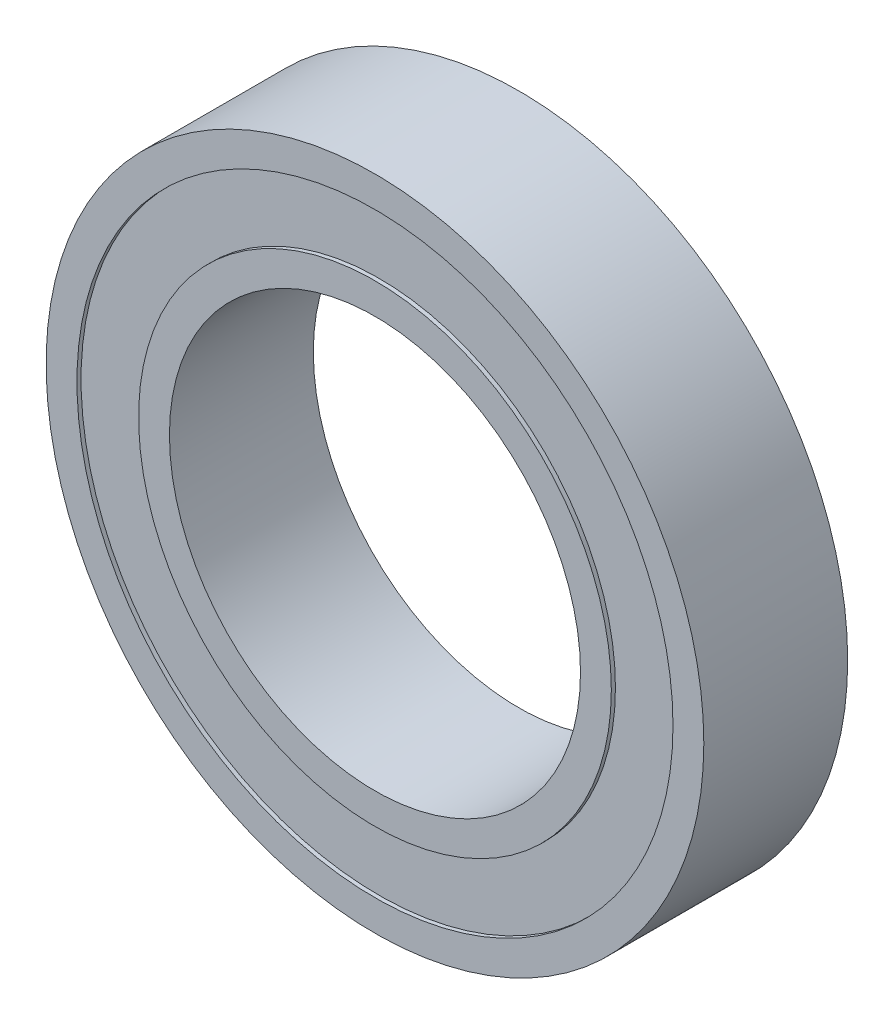
ISO-10303-21;
HEADER;
FILE_DESCRIPTION(('STEP AP214'),'2;1');
FILE_NAME('part.step','',(''),(''),'','','');
FILE_SCHEMA(('AUTOMOTIVE_DESIGN { 1 0 10303 214 1 1 1 1 }'));
ENDSEC;
DATA;
#1=APPLICATION_CONTEXT('core data for automotive mechanical design processes');
#2=APPLICATION_PROTOCOL_DEFINITION('international standard','automotive_design',2000,#1);
#3=PRODUCT_CONTEXT('',#1,'mechanical');
#4=PRODUCT('Part','Part','',(#3));
#5=PRODUCT_RELATED_PRODUCT_CATEGORY('part','',(#4));
#6=PRODUCT_DEFINITION_FORMATION('','',#4);
#7=PRODUCT_DEFINITION_CONTEXT('part definition',#1,'design');
#8=PRODUCT_DEFINITION('design','',#6,#7);
#9=PRODUCT_DEFINITION_SHAPE('','',#8);
#10=(LENGTH_UNIT() NAMED_UNIT(*) SI_UNIT(.MILLI.,.METRE.));
#11=(NAMED_UNIT(*) PLANE_ANGLE_UNIT() SI_UNIT($,.RADIAN.));
#12=(NAMED_UNIT(*) SI_UNIT($,.STERADIAN.) SOLID_ANGLE_UNIT());
#13=UNCERTAINTY_MEASURE_WITH_UNIT(LENGTH_MEASURE(1.E-05),#10,'distance_accuracy_value','');
#14=(GEOMETRIC_REPRESENTATION_CONTEXT(3) GLOBAL_UNCERTAINTY_ASSIGNED_CONTEXT((#13)) GLOBAL_UNIT_ASSIGNED_CONTEXT((#10,
#11,#12)) REPRESENTATION_CONTEXT('',''));
#15=CARTESIAN_POINT('',(0.,0.,0.));
#16=DIRECTION('',(0.,0.,1.));
#17=DIRECTION('',(1.,0.,0.));
#18=AXIS2_PLACEMENT_3D('',#15,#16,#17);
#19=CARTESIAN_POINT('',(0.,0.,0.));
#20=DIRECTION('',(0.,0.,1.));
#21=DIRECTION('',(1.,0.,0.));
#22=AXIS2_PLACEMENT_3D('',#19,#20,#21);
#23=PLANE('',#22);
#24=CARTESIAN_POINT('',(0.,0.,0.));
#25=DIRECTION('',(0.,0.,1.));
#26=DIRECTION('',(1.,0.,0.));
#27=AXIS2_PLACEMENT_3D('',#24,#25,#26);
#28=CIRCLE('',#27,10.);
#29=CARTESIAN_POINT('',(10.,0.,0.));
#30=VERTEX_POINT('',#29);
#31=EDGE_CURVE('E51',#30,#30,#28,.T.);
#32=ORIENTED_EDGE('',*,*,#31,.T.);
#33=EDGE_LOOP('',(#32));
#34=FACE_BOUND('',#33,.T.);
#35=CARTESIAN_POINT('',(0.,0.,0.));
#36=DIRECTION('',(0.,0.,-1.));
#37=DIRECTION('',(-1.,0.,0.));
#38=AXIS2_PLACEMENT_3D('',#35,#36,#37);
#39=CIRCLE('',#38,11.5);
#40=CARTESIAN_POINT('',(-11.5,0.,0.));
#41=VERTEX_POINT('',#40);
#42=EDGE_CURVE('E83',#41,#41,#39,.T.);
#43=ORIENTED_EDGE('',*,*,#42,.T.);
#44=EDGE_LOOP('',(#43));
#45=FACE_BOUND('',#44,.T.);
#46=ADVANCED_FACE('F36',(#34,#45),#23,.F.);
#47=CARTESIAN_POINT('',(0.,0.,7.));
#48=DIRECTION('',(0.,0.,1.));
#49=DIRECTION('',(1.,0.,0.));
#50=AXIS2_PLACEMENT_3D('',#47,#48,#49);
#51=PLANE('',#50);
#52=CARTESIAN_POINT('',(0.,0.,7.));
#53=DIRECTION('',(0.,0.,1.));
#54=DIRECTION('',(1.,0.,0.));
#55=AXIS2_PLACEMENT_3D('',#52,#53,#54);
#56=CIRCLE('',#55,10.);
#57=CARTESIAN_POINT('',(10.,0.,7.));
#58=VERTEX_POINT('',#57);
#59=EDGE_CURVE('E49',#58,#58,#56,.T.);
#60=ORIENTED_EDGE('',*,*,#59,.F.);
#61=EDGE_LOOP('',(#60));
#62=FACE_BOUND('',#61,.T.);
#63=CARTESIAN_POINT('',(0.,0.,7.));
#64=DIRECTION('',(0.,0.,1.));
#65=DIRECTION('',(1.,0.,0.));
#66=AXIS2_PLACEMENT_3D('',#63,#64,#65);
#67=CIRCLE('',#66,11.5);
#68=CARTESIAN_POINT('',(11.5,0.,7.));
#69=VERTEX_POINT('',#68);
#70=EDGE_CURVE('E67',#69,#69,#67,.T.);
#71=ORIENTED_EDGE('',*,*,#70,.T.);
#72=EDGE_LOOP('',(#71));
#73=FACE_BOUND('',#72,.T.);
#74=ADVANCED_FACE('F123',(#62,#73),#51,.T.);
#75=CARTESIAN_POINT('',(0.,0.,7.));
#76=DIRECTION('',(0.,0.,1.));
#77=DIRECTION('',(1.,0.,0.));
#78=AXIS2_PLACEMENT_3D('',#75,#76,#77);
#79=CIRCLE('',#78,14.5);
#80=CARTESIAN_POINT('',(14.5,0.,7.));
#81=VERTEX_POINT('',#80);
#82=EDGE_CURVE('E59',#81,#81,#79,.T.);
#83=ORIENTED_EDGE('',*,*,#82,.F.);
#84=EDGE_LOOP('',(#83));
#85=FACE_BOUND('',#84,.T.);
#86=CARTESIAN_POINT('',(0.,0.,7.));
#87=DIRECTION('',(0.,0.,1.));
#88=DIRECTION('',(1.,0.,0.));
#89=AXIS2_PLACEMENT_3D('',#86,#87,#88);
#90=CIRCLE('',#89,16.);
#91=CARTESIAN_POINT('',(16.,0.,7.));
#92=VERTEX_POINT('',#91);
#93=EDGE_CURVE('E10',#92,#92,#90,.T.);
#94=ORIENTED_EDGE('',*,*,#93,.T.);
#95=EDGE_LOOP('',(#94));
#96=FACE_BOUND('',#95,.T.);
#97=ADVANCED_FACE('F110',(#85,#96),#51,.T.);
#98=CARTESIAN_POINT('',(0.,0.,0.));
#99=DIRECTION('',(0.,0.,-1.));
#100=DIRECTION('',(-1.,0.,0.));
#101=AXIS2_PLACEMENT_3D('',#98,#99,#100);
#102=CIRCLE('',#101,14.5);
#103=CARTESIAN_POINT('',(-14.5,0.,0.));
#104=VERTEX_POINT('',#103);
#105=EDGE_CURVE('E75',#104,#104,#102,.T.);
#106=ORIENTED_EDGE('',*,*,#105,.F.);
#107=EDGE_LOOP('',(#106));
#108=FACE_BOUND('',#107,.T.);
#109=CARTESIAN_POINT('',(0.,0.,0.));
#110=DIRECTION('',(0.,0.,1.));
#111=DIRECTION('',(1.,0.,0.));
#112=AXIS2_PLACEMENT_3D('',#109,#110,#111);
#113=CIRCLE('',#112,16.);
#114=CARTESIAN_POINT('',(16.,0.,0.));
#115=VERTEX_POINT('',#114);
#116=EDGE_CURVE('E40',#115,#115,#113,.T.);
#117=ORIENTED_EDGE('',*,*,#116,.F.);
#118=EDGE_LOOP('',(#117));
#119=FACE_BOUND('',#118,.T.);
#120=ADVANCED_FACE('F107',(#108,#119),#23,.F.);
#121=CARTESIAN_POINT('',(0.,0.,7.));
#122=DIRECTION('',(0.,0.,-1.));
#123=DIRECTION('',(-1.,0.,0.));
#124=AXIS2_PLACEMENT_3D('',#121,#122,#123);
#125=CYLINDRICAL_SURFACE('',#124,16.);
#126=ORIENTED_EDGE('',*,*,#93,.F.);
#127=EDGE_LOOP('',(#126));
#128=FACE_BOUND('',#127,.T.);
#129=ORIENTED_EDGE('',*,*,#116,.T.);
#130=EDGE_LOOP('',(#129));
#131=FACE_BOUND('',#130,.T.);
#132=ADVANCED_FACE('F38',(#128,#131),#125,.T.);
#133=CARTESIAN_POINT('',(0.,0.,7.));
#134=DIRECTION('',(0.,0.,-1.));
#135=DIRECTION('',(-1.,0.,0.));
#136=AXIS2_PLACEMENT_3D('',#133,#134,#135);
#137=CYLINDRICAL_SURFACE('',#136,10.);
#138=ORIENTED_EDGE('',*,*,#59,.T.);
#139=EDGE_LOOP('',(#138));
#140=FACE_BOUND('',#139,.T.);
#141=ORIENTED_EDGE('',*,*,#31,.F.);
#142=EDGE_LOOP('',(#141));
#143=FACE_BOUND('',#142,.T.);
#144=ADVANCED_FACE('F114',(#140,#143),#137,.F.);
#145=CARTESIAN_POINT('',(0.,0.,6.8));
#146=DIRECTION('',(0.,0.,1.));
#147=DIRECTION('',(1.,0.,0.));
#148=AXIS2_PLACEMENT_3D('',#145,#146,#147);
#149=CYLINDRICAL_SURFACE('',#148,14.5);
#150=CARTESIAN_POINT('',(0.,0.,6.8));
#151=DIRECTION('',(0.,0.,1.));
#152=DIRECTION('',(1.,0.,0.));
#153=AXIS2_PLACEMENT_3D('',#150,#151,#152);
#154=CIRCLE('',#153,14.5);
#155=CARTESIAN_POINT('',(14.5,0.,6.8));
#156=VERTEX_POINT('',#155);
#157=EDGE_CURVE('E55',#156,#156,#154,.T.);
#158=ORIENTED_EDGE('',*,*,#157,.F.);
#159=EDGE_LOOP('',(#158));
#160=FACE_BOUND('',#159,.T.);
#161=ORIENTED_EDGE('',*,*,#82,.T.);
#162=EDGE_LOOP('',(#161));
#163=FACE_BOUND('',#162,.T.);
#164=ADVANCED_FACE('F119',(#160,#163),#149,.F.);
#165=CARTESIAN_POINT('',(0.,0.,6.8));
#166=DIRECTION('',(0.,0.,1.));
#167=DIRECTION('',(1.,0.,0.));
#168=AXIS2_PLACEMENT_3D('',#165,#166,#167);
#169=PLANE('',#168);
#170=CARTESIAN_POINT('',(0.,0.,6.8));
#171=DIRECTION('',(0.,0.,1.));
#172=DIRECTION('',(1.,0.,0.));
#173=AXIS2_PLACEMENT_3D('',#170,#171,#172);
#174=CIRCLE('',#173,11.5);
#175=CARTESIAN_POINT('',(11.5,0.,6.8));
#176=VERTEX_POINT('',#175);
#177=EDGE_CURVE('E63',#176,#176,#174,.T.);
#178=ORIENTED_EDGE('',*,*,#177,.F.);
#179=EDGE_LOOP('',(#178));
#180=FACE_BOUND('',#179,.T.);
#181=ORIENTED_EDGE('',*,*,#157,.T.);
#182=EDGE_LOOP('',(#181));
#183=FACE_BOUND('',#182,.T.);
#184=ADVANCED_FACE('F136',(#180,#183),#169,.T.);
#185=CARTESIAN_POINT('',(0.,0.,6.8));
#186=DIRECTION('',(0.,0.,1.));
#187=DIRECTION('',(1.,0.,0.));
#188=AXIS2_PLACEMENT_3D('',#185,#186,#187);
#189=CYLINDRICAL_SURFACE('',#188,11.5);
#190=ORIENTED_EDGE('',*,*,#177,.T.);
#191=EDGE_LOOP('',(#190));
#192=FACE_BOUND('',#191,.T.);
#193=ORIENTED_EDGE('',*,*,#70,.F.);
#194=EDGE_LOOP('',(#193));
#195=FACE_BOUND('',#194,.T.);
#196=ADVANCED_FACE('F103',(#192,#195),#189,.T.);
#197=CARTESIAN_POINT('',(0.,0.,0.2));
#198=DIRECTION('',(0.,0.,-1.));
#199=DIRECTION('',(-1.,0.,0.));
#200=AXIS2_PLACEMENT_3D('',#197,#198,#199);
#201=CYLINDRICAL_SURFACE('',#200,14.5);
#202=CARTESIAN_POINT('',(0.,0.,0.2));
#203=DIRECTION('',(0.,0.,-1.));
#204=DIRECTION('',(-1.,0.,0.));
#205=AXIS2_PLACEMENT_3D('',#202,#203,#204);
#206=CIRCLE('',#205,14.5);
#207=CARTESIAN_POINT('',(-14.5,0.,0.2));
#208=VERTEX_POINT('',#207);
#209=EDGE_CURVE('E71',#208,#208,#206,.T.);
#210=ORIENTED_EDGE('',*,*,#209,.F.);
#211=EDGE_LOOP('',(#210));
#212=FACE_BOUND('',#211,.T.);
#213=ORIENTED_EDGE('',*,*,#105,.T.);
#214=EDGE_LOOP('',(#213));
#215=FACE_BOUND('',#214,.T.);
#216=ADVANCED_FACE('F97',(#212,#215),#201,.F.);
#217=CARTESIAN_POINT('',(0.,0.,0.2));
#218=DIRECTION('',(0.,0.,-1.));
#219=DIRECTION('',(-1.,0.,0.));
#220=AXIS2_PLACEMENT_3D('',#217,#218,#219);
#221=PLANE('',#220);
#222=CARTESIAN_POINT('',(0.,0.,0.2));
#223=DIRECTION('',(0.,0.,-1.));
#224=DIRECTION('',(-1.,0.,0.));
#225=AXIS2_PLACEMENT_3D('',#222,#223,#224);
#226=CIRCLE('',#225,11.5);
#227=CARTESIAN_POINT('',(-11.5,0.,0.2));
#228=VERTEX_POINT('',#227);
#229=EDGE_CURVE('E79',#228,#228,#226,.T.);
#230=ORIENTED_EDGE('',*,*,#229,.F.);
#231=EDGE_LOOP('',(#230));
#232=FACE_BOUND('',#231,.T.);
#233=ORIENTED_EDGE('',*,*,#209,.T.);
#234=EDGE_LOOP('',(#233));
#235=FACE_BOUND('',#234,.T.);
#236=ADVANCED_FACE('F94',(#232,#235),#221,.T.);
#237=CARTESIAN_POINT('',(0.,0.,0.2));
#238=DIRECTION('',(0.,0.,-1.));
#239=DIRECTION('',(-1.,0.,0.));
#240=AXIS2_PLACEMENT_3D('',#237,#238,#239);
#241=CYLINDRICAL_SURFACE('',#240,11.5);
#242=ORIENTED_EDGE('',*,*,#229,.T.);
#243=EDGE_LOOP('',(#242));
#244=FACE_BOUND('',#243,.T.);
#245=ORIENTED_EDGE('',*,*,#42,.F.);
#246=EDGE_LOOP('',(#245));
#247=FACE_BOUND('',#246,.T.);
#248=ADVANCED_FACE('F91',(#244,#247),#241,.T.);
#249=CLOSED_SHELL('',(#46,#74,#97,#120,#132,#144,#164,#184,#196,#216,#236,#248));
#250=MANIFOLD_SOLID_BREP('B2',#249);
#251=ADVANCED_BREP_SHAPE_REPRESENTATION('',(#18,#250),#14);
#252=SHAPE_DEFINITION_REPRESENTATION(#9,#251);
ENDSEC;
END-ISO-10303-21;
